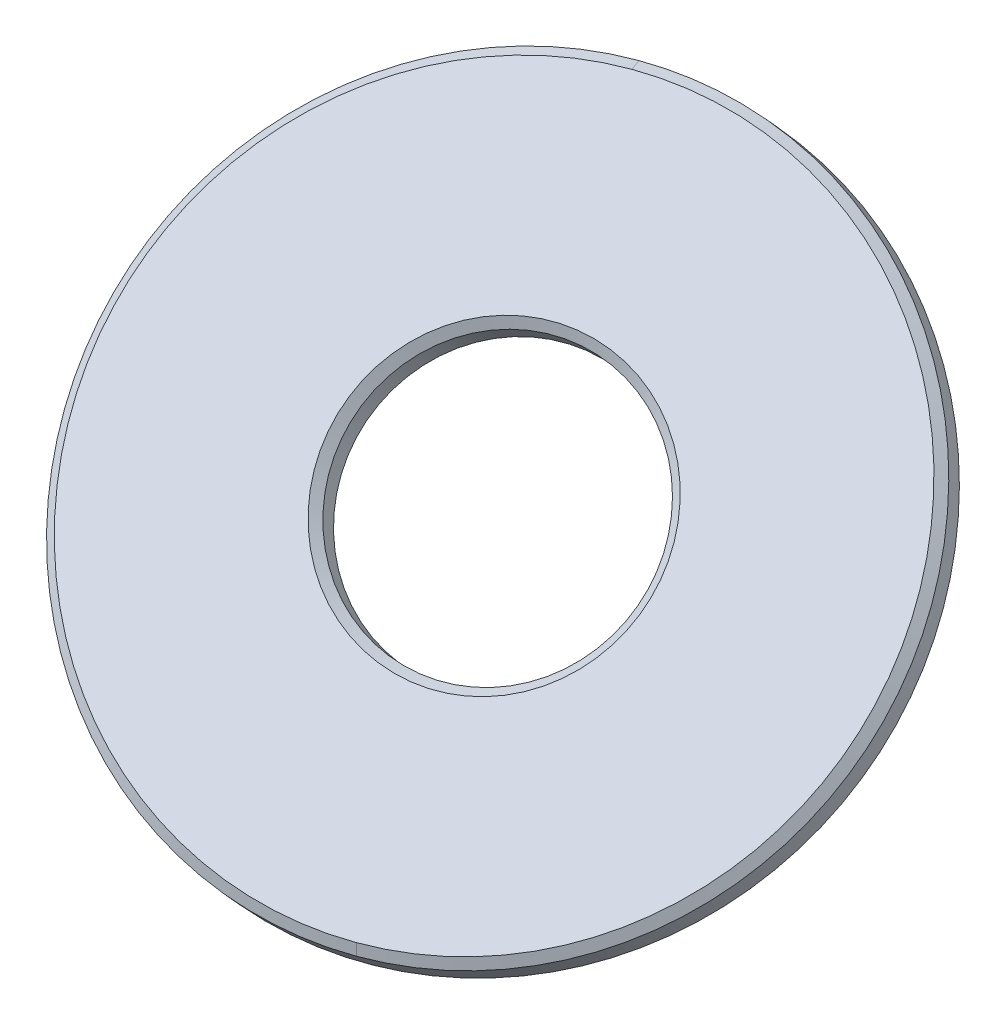
ISO-10303-21;
HEADER;
FILE_DESCRIPTION(('STEP AP214'),'2;1');
FILE_NAME('part.step','',(''),(''),'','','');
FILE_SCHEMA(('AUTOMOTIVE_DESIGN { 1 0 10303 214 1 1 1 1 }'));
ENDSEC;
DATA;
#1=APPLICATION_CONTEXT('core data for automotive mechanical design processes');
#2=APPLICATION_PROTOCOL_DEFINITION('international standard','automotive_design',2000,#1);
#3=PRODUCT_CONTEXT('',#1,'mechanical');
#4=PRODUCT('Part','Part','',(#3));
#5=PRODUCT_RELATED_PRODUCT_CATEGORY('part','',(#4));
#6=PRODUCT_DEFINITION_FORMATION('','',#4);
#7=PRODUCT_DEFINITION_CONTEXT('part definition',#1,'design');
#8=PRODUCT_DEFINITION('design','',#6,#7);
#9=PRODUCT_DEFINITION_SHAPE('','',#8);
#10=(LENGTH_UNIT() NAMED_UNIT(*) SI_UNIT(.MILLI.,.METRE.));
#11=(NAMED_UNIT(*) PLANE_ANGLE_UNIT() SI_UNIT($,.RADIAN.));
#12=(NAMED_UNIT(*) SI_UNIT($,.STERADIAN.) SOLID_ANGLE_UNIT());
#13=UNCERTAINTY_MEASURE_WITH_UNIT(LENGTH_MEASURE(1.E-05),#10,'distance_accuracy_value','');
#14=(GEOMETRIC_REPRESENTATION_CONTEXT(3) GLOBAL_UNCERTAINTY_ASSIGNED_CONTEXT((#13)) GLOBAL_UNIT_ASSIGNED_CONTEXT((#10,
#11,#12)) REPRESENTATION_CONTEXT('',''));
#15=CARTESIAN_POINT('',(0.,0.,0.));
#16=DIRECTION('',(0.,0.,1.));
#17=DIRECTION('',(1.,0.,0.));
#18=AXIS2_PLACEMENT_3D('',#15,#16,#17);
#19=CARTESIAN_POINT('',(-32.16222541389,39.54180912722,29.39432240413));
#20=DIRECTION('',(-0.241844762648003,-0.707106781186508,-0.664463024388707));
#21=DIRECTION('',(0.,0.684791078771774,-0.728739444818647));
#22=AXIS2_PLACEMENT_3D('',#19,#20,#21);
#23=PLANE('',#22);
#24=CARTESIAN_POINT('',(-32.162225413883,39.5418091272327,29.3943224041515));
#25=DIRECTION('',(-0.241844762647999,-0.70710678118651,-0.664463024388706));
#26=DIRECTION('',(0.,0.684791078771772,-0.728739444818649));
#27=AXIS2_PLACEMENT_3D('',#24,#25,#26);
#28=CIRCLE('',#27,1.6500000000391);
#29=CARTESIAN_POINT('',(-32.162225413883,40.6717144072329,28.1919023201722));
#30=VERTEX_POINT('',#29);
#31=EDGE_CURVE('E70',#30,#30,#28,.F.);
#32=ORIENTED_EDGE('',*,*,#31,.T.);
#33=EDGE_LOOP('',(#32));
#34=FACE_BOUND('',#33,.T.);
#35=CARTESIAN_POINT('',(-32.162225413892,39.5418091272017,29.3943224041115));
#36=DIRECTION('',(0.241844762648003,0.707106781186508,0.664463024388707));
#37=DIRECTION('',(0.,-0.684791078771774,0.728739444818647));
#38=AXIS2_PLACEMENT_3D('',#35,#36,#37);
#39=CIRCLE('',#38,3.89999999996456);
#40=CARTESIAN_POINT('',(-32.162225413892,36.8711239200161,32.2364062388784));
#41=VERTEX_POINT('',#40);
#42=EDGE_CURVE('E19',#41,#41,#39,.T.);
#43=ORIENTED_EDGE('',*,*,#42,.F.);
#44=EDGE_LOOP('',(#43));
#45=FACE_BOUND('',#44,.T.);
#46=ADVANCED_FACE('F16',(#34,#45),#23,.T.);
#47=CARTESIAN_POINT('',(-32.1380409376204,39.6125198053403,29.4607687065691));
#48=DIRECTION('',(0.241844762648003,0.707106781186508,0.664463024388707));
#49=DIRECTION('',(0.,-0.684791078771774,0.728739444818647));
#50=AXIS2_PLACEMENT_3D('',#47,#48,#49);
#51=CONICAL_SURFACE('',#50,3.99999999998053,0.78539816333635);
#52=CARTESIAN_POINT('',(-32.1380409376253,39.6125198053383,29.4607687065686));
#53=DIRECTION('',(-0.241844762648003,-0.707106781186508,-0.664463024388707));
#54=DIRECTION('',(0.,0.684791078771774,-0.728739444818647));
#55=AXIS2_PLACEMENT_3D('',#52,#53,#54);
#56=CIRCLE('',#55,4.);
#57=CARTESIAN_POINT('',(-32.1380409376253,42.3516841204254,26.545810927294));
#58=VERTEX_POINT('',#57);
#59=EDGE_CURVE('E68',#58,#58,#56,.F.);
#60=ORIENTED_EDGE('',*,*,#59,.F.);
#61=EDGE_LOOP('',(#60));
#62=FACE_BOUND('',#61,.T.);
#63=ORIENTED_EDGE('',*,*,#42,.T.);
#64=EDGE_LOOP('',(#63));
#65=FACE_BOUND('',#64,.T.);
#66=ADVANCED_FACE('F79',(#62,#65),#51,.T.);
#67=CARTESIAN_POINT('',(-32.162225413883,39.5418091272327,29.3943224041515));
#68=DIRECTION('',(-0.241844762647999,-0.70710678118651,-0.664463024388706));
#69=DIRECTION('',(0.,0.684791078771772,-0.728739444818649));
#70=AXIS2_PLACEMENT_3D('',#67,#68,#69);
#71=CONICAL_SURFACE('',#70,1.6500000000391,0.78539816335748);
#72=CARTESIAN_POINT('',(-32.1380409376285,39.6125198053373,29.4607687065764));
#73=DIRECTION('',(0.241844762648003,0.707106781186508,0.664463024388707));
#74=DIRECTION('',(0.,-0.684791078771774,0.728739444818647));
#75=AXIS2_PLACEMENT_3D('',#72,#73,#74);
#76=CIRCLE('',#75,1.55);
#77=CARTESIAN_POINT('',(-32.1380409376285,38.5510936332411,30.5903148460453));
#78=VERTEX_POINT('',#77);
#79=EDGE_CURVE('E52',#78,#78,#76,.T.);
#80=ORIENTED_EDGE('',*,*,#79,.T.);
#81=EDGE_LOOP('',(#80));
#82=FACE_BOUND('',#81,.T.);
#83=ORIENTED_EDGE('',*,*,#31,.F.);
#84=EDGE_LOOP('',(#83));
#85=FACE_BOUND('',#84,.T.);
#86=ADVANCED_FACE('F86',(#82,#85),#71,.F.);
#87=CARTESIAN_POINT('',(-32.16222541389,39.54180912722,29.39432240413));
#88=DIRECTION('',(-0.241844762648003,-0.707106781186508,-0.664463024388707));
#89=DIRECTION('',(0.,0.684791078771774,-0.728739444818647));
#90=AXIS2_PLACEMENT_3D('',#87,#88,#89);
#91=CYLINDRICAL_SURFACE('',#90,4.);
#92=ORIENTED_EDGE('',*,*,#59,.T.);
#93=EDGE_LOOP('',(#92));
#94=FACE_BOUND('',#93,.T.);
#95=CARTESIAN_POINT('',(-32.065487508824,39.824651839706,29.6601076138962));
#96=DIRECTION('',(-0.241844762648003,-0.707106781186508,-0.664463024388707));
#97=DIRECTION('',(-0.970314954424455,0.176241818066678,0.165613135906608));
#98=AXIS2_PLACEMENT_3D('',#95,#96,#97);
#99=CIRCLE('',#98,3.999999999954);
#100=CARTESIAN_POINT('',(-33.0328665594211,42.6530789644179,27.0022555162742));
#101=VERTEX_POINT('',#100);
#102=CARTESIAN_POINT('',(-31.0981084582342,36.996224714992,32.3179597114164));
#103=VERTEX_POINT('',#102);
#104=EDGE_CURVE('E55',#101,#103,#99,.F.);
#105=ORIENTED_EDGE('',*,*,#104,.F.);
#106=CARTESIAN_POINT('',(-32.065487508824,39.824651839706,29.6601076138962));
#107=DIRECTION('',(-0.241844762648003,-0.707106781186508,-0.664463024388707));
#108=DIRECTION('',(-0.970314954424455,0.176241818066678,0.165613135906608));
#109=AXIS2_PLACEMENT_3D('',#106,#107,#108);
#110=CIRCLE('',#109,3.999999999954);
#111=EDGE_CURVE('E46',#103,#101,#110,.F.);
#112=ORIENTED_EDGE('',*,*,#111,.F.);
#113=EDGE_LOOP('',(#105,#112));
#114=FACE_BOUND('',#113,.T.);
#115=ADVANCED_FACE('F57',(#94,#114),#91,.T.);
#116=CARTESIAN_POINT('',(-32.04130303257,39.89536251781,29.72655391633));
#117=DIRECTION('',(0.241844762648003,0.707106781186508,0.664463024388707));
#118=DIRECTION('',(0.,-0.684791078771774,0.728739444818647));
#119=AXIS2_PLACEMENT_3D('',#116,#117,#118);
#120=CYLINDRICAL_SURFACE('',#119,1.55);
#121=ORIENTED_EDGE('',*,*,#79,.F.);
#122=EDGE_LOOP('',(#121));
#123=FACE_BOUND('',#122,.T.);
#124=CARTESIAN_POINT('',(-32.0654875088166,39.824651839713,29.6601076139113));
#125=DIRECTION('',(0.241844762648003,0.707106781186508,0.664463024388707));
#126=DIRECTION('',(-0.970314954424455,0.17624181805516,0.165613135918863));
#127=AXIS2_PLACEMENT_3D('',#124,#125,#126);
#128=CIRCLE('',#127,1.55000000000785);
#129=CARTESIAN_POINT('',(-33.5694756881821,40.0978266576999,29.9168079745868));
#130=VERTEX_POINT('',#129);
#131=EDGE_CURVE('E59',#130,#130,#128,.T.);
#132=ORIENTED_EDGE('',*,*,#131,.T.);
#133=EDGE_LOOP('',(#132));
#134=FACE_BOUND('',#133,.T.);
#135=ADVANCED_FACE('F104',(#123,#134),#120,.F.);
#136=CARTESIAN_POINT('',(-32.065487508824,39.824651839706,29.6601076138962));
#137=DIRECTION('',(-0.241844762648001,-0.707106781186508,-0.664463024388707));
#138=DIRECTION('',(0.,0.684791078771774,-0.728739444818647));
#139=AXIS2_PLACEMENT_3D('',#136,#137,#138);
#140=CONICAL_SURFACE('',#139,3.999999999954,0.785398163348843);
#141=DIRECTION('',(0.342020143328698,0.,0.939692620784806));
#142=VECTOR('',#141,1.);
#143=CARTESIAN_POINT('',(-199135.249068372,42.6530789106248,-547001.840916849));
#144=LINE('',#143,#142);
#145=CARTESIAN_POINT('',(-32.9844976069058,42.6530789644455,27.1351481211396));
#146=VERTEX_POINT('',#145);
#147=EDGE_CURVE('E49',#146,#101,#144,.F.);
#148=ORIENTED_EDGE('',*,*,#147,.F.);
#149=CARTESIAN_POINT('',(-32.0413030325854,39.8953625177481,29.7265539162631));
#150=DIRECTION('',(-0.241844762648001,-0.707106781186508,-0.664463024388707));
#151=DIRECTION('',(0.,0.684791078771774,-0.728739444818647));
#152=AXIS2_PLACEMENT_3D('',#149,#150,#151);
#153=CIRCLE('',#152,3.90000000007195);
#154=CARTESIAN_POINT('',(-31.0981084582377,37.1376460712039,32.3179597113994));
#155=VERTEX_POINT('',#154);
#156=EDGE_CURVE('E38',#146,#155,#153,.T.);
#157=ORIENTED_EDGE('',*,*,#156,.T.);
#158=DIRECTION('',(-1.49746881561441E-12,1.,7.63153429339525E-13));
#159=VECTOR('',#158,1.);
#160=CARTESIAN_POINT('',(-31.0981075865071,-582098.939583211,32.3179592671403));
#161=LINE('',#160,#159);
#162=EDGE_CURVE('E32',#103,#155,#161,.T.);
#163=ORIENTED_EDGE('',*,*,#162,.F.);
#164=ORIENTED_EDGE('',*,*,#111,.T.);
#165=EDGE_LOOP('',(#148,#157,#163,#164));
#166=FACE_BOUND('',#165,.T.);
#167=ADVANCED_FACE('F48',(#166),#140,.T.);
#168=CARTESIAN_POINT('',(-32.0654875088401,39.824651839659,29.660107613852));
#169=DIRECTION('',(-0.241844762648002,-0.707106781186508,-0.664463024388707));
#170=DIRECTION('',(0.,0.684791078771774,-0.728739444818647));
#171=AXIS2_PLACEMENT_3D('',#168,#169,#170);
#172=CONICAL_SURFACE('',#171,4.0000000000546,0.785398163519446);
#173=ORIENTED_EDGE('',*,*,#162,.T.);
#174=CARTESIAN_POINT('',(-32.0413030325601,39.8953625178219,29.7265539163324));
#175=DIRECTION('',(-0.241844762648002,-0.707106781186508,-0.664463024388707));
#176=DIRECTION('',(0.,0.684791078771774,-0.728739444818647));
#177=AXIS2_PLACEMENT_3D('',#174,#175,#176);
#178=CIRCLE('',#177,3.89999999996766);
#179=EDGE_CURVE('E24',#155,#146,#178,.T.);
#180=ORIENTED_EDGE('',*,*,#179,.T.);
#181=ORIENTED_EDGE('',*,*,#147,.T.);
#182=ORIENTED_EDGE('',*,*,#104,.T.);
#183=EDGE_LOOP('',(#173,#180,#181,#182));
#184=FACE_BOUND('',#183,.T.);
#185=ADVANCED_FACE('F54',(#184),#172,.T.);
#186=CARTESIAN_POINT('',(-32.0413030325885,39.8953625177244,29.7265539162494));
#187=DIRECTION('',(0.241844762647997,0.707106781186509,0.664463024388708));
#188=DIRECTION('',(0.,-0.684791078771774,0.728739444818647));
#189=AXIS2_PLACEMENT_3D('',#186,#187,#188);
#190=CONICAL_SURFACE('',#189,1.64999999990241,0.785398163680828);
#191=ORIENTED_EDGE('',*,*,#131,.F.);
#192=EDGE_LOOP('',(#191));
#193=FACE_BOUND('',#192,.T.);
#194=CARTESIAN_POINT('',(-32.0413030325771,39.8953625177576,29.7265539162806));
#195=DIRECTION('',(0.241844762647997,0.707106781186509,0.664463024388708));
#196=DIRECTION('',(0.,-0.684791078771774,0.728739444818647));
#197=AXIS2_PLACEMENT_3D('',#194,#195,#196);
#198=CIRCLE('',#197,1.64999999994945);
#199=CARTESIAN_POINT('',(-32.0413030325771,38.7654572378188,30.9289740001945));
#200=VERTEX_POINT('',#199);
#201=EDGE_CURVE('E11',#200,#200,#198,.T.);
#202=ORIENTED_EDGE('',*,*,#201,.T.);
#203=EDGE_LOOP('',(#202));
#204=FACE_BOUND('',#203,.T.);
#205=ADVANCED_FACE('F90',(#193,#204),#190,.F.);
#206=CARTESIAN_POINT('',(-32.04130303257,39.89536251781,29.72655391633));
#207=DIRECTION('',(-0.241844762648003,-0.707106781186508,-0.664463024388707));
#208=DIRECTION('',(0.,0.684791078771774,-0.728739444818647));
#209=AXIS2_PLACEMENT_3D('',#206,#207,#208);
#210=PLANE('',#209);
#211=ORIENTED_EDGE('',*,*,#201,.F.);
#212=EDGE_LOOP('',(#211));
#213=FACE_BOUND('',#212,.T.);
#214=ORIENTED_EDGE('',*,*,#156,.F.);
#215=ORIENTED_EDGE('',*,*,#179,.F.);
#216=EDGE_LOOP('',(#214,#215));
#217=FACE_BOUND('',#216,.T.);
#218=ADVANCED_FACE('F88',(#213,#217),#210,.F.);
#219=CLOSED_SHELL('',(#46,#66,#86,#115,#135,#167,#185,#205,#218));
#220=MANIFOLD_SOLID_BREP('B1',#219);
#221=ADVANCED_BREP_SHAPE_REPRESENTATION('',(#18,#220),#14);
#222=SHAPE_DEFINITION_REPRESENTATION(#9,#221);
ENDSEC;
END-ISO-10303-21;
